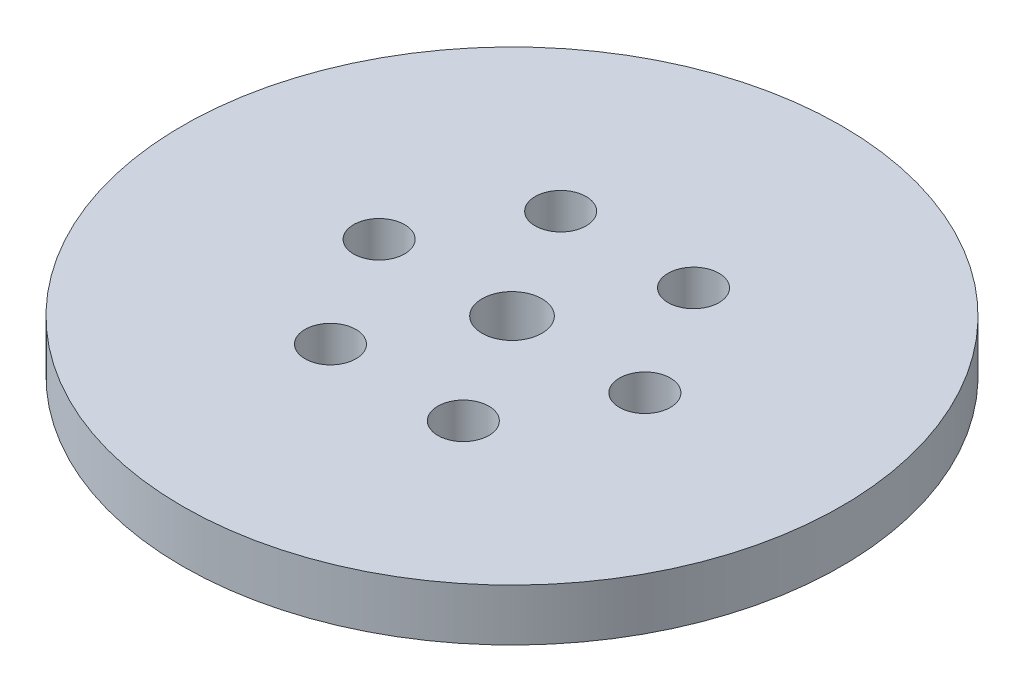
ISO-10303-21;
HEADER;
FILE_DESCRIPTION(('STEP AP214'),'2;1');
FILE_NAME('part.step','',(''),(''),'','','');
FILE_SCHEMA(('AUTOMOTIVE_DESIGN { 1 0 10303 214 1 1 1 1 }'));
ENDSEC;
DATA;
#1=APPLICATION_CONTEXT('core data for automotive mechanical design processes');
#2=APPLICATION_PROTOCOL_DEFINITION('international standard','automotive_design',2000,#1);
#3=PRODUCT_CONTEXT('',#1,'mechanical');
#4=PRODUCT('Part','Part','',(#3));
#5=PRODUCT_RELATED_PRODUCT_CATEGORY('part','',(#4));
#6=PRODUCT_DEFINITION_FORMATION('','',#4);
#7=PRODUCT_DEFINITION_CONTEXT('part definition',#1,'design');
#8=PRODUCT_DEFINITION('design','',#6,#7);
#9=PRODUCT_DEFINITION_SHAPE('','',#8);
#10=(LENGTH_UNIT() NAMED_UNIT(*) SI_UNIT(.MILLI.,.METRE.));
#11=(NAMED_UNIT(*) PLANE_ANGLE_UNIT() SI_UNIT($,.RADIAN.));
#12=(NAMED_UNIT(*) SI_UNIT($,.STERADIAN.) SOLID_ANGLE_UNIT());
#13=UNCERTAINTY_MEASURE_WITH_UNIT(LENGTH_MEASURE(1.E-05),#10,'distance_accuracy_value','');
#14=(GEOMETRIC_REPRESENTATION_CONTEXT(3) GLOBAL_UNCERTAINTY_ASSIGNED_CONTEXT((#13)) GLOBAL_UNIT_ASSIGNED_CONTEXT((#10,
#11,#12)) REPRESENTATION_CONTEXT('',''));
#15=CARTESIAN_POINT('',(0.,0.,0.));
#16=DIRECTION('',(0.,0.,1.));
#17=DIRECTION('',(1.,0.,0.));
#18=AXIS2_PLACEMENT_3D('',#15,#16,#17);
#19=CARTESIAN_POINT('',(0.,13.,0.));
#20=DIRECTION('',(0.,-1.,0.));
#21=DIRECTION('',(0.,0.,-1.));
#22=AXIS2_PLACEMENT_3D('',#19,#20,#21);
#23=CYLINDRICAL_SURFACE('',#22,82.5);
#24=CARTESIAN_POINT('',(0.,13.,0.));
#25=DIRECTION('',(0.,1.,0.));
#26=DIRECTION('',(0.,0.,1.));
#27=AXIS2_PLACEMENT_3D('',#24,#25,#26);
#28=CIRCLE('',#27,82.5);
#29=CARTESIAN_POINT('',(0.,13.,-82.5));
#30=VERTEX_POINT('',#29);
#31=EDGE_CURVE('E10',#30,#30,#28,.T.);
#32=CARTESIAN_POINT('',(0.,0.,0.));
#33=DIRECTION('',(0.,1.,0.));
#34=DIRECTION('',(0.,0.,1.));
#35=AXIS2_PLACEMENT_3D('',#32,#33,#34);
#36=CIRCLE('',#35,82.5);
#37=CARTESIAN_POINT('',(0.,0.,-82.5));
#38=VERTEX_POINT('',#37);
#39=EDGE_CURVE('E37',#38,#38,#36,.T.);
#40=CARTESIAN_POINT('',(0.,13.,-82.5));
#41=CARTESIAN_POINT('',(0.,12.8645833333333,-82.5));
#42=CARTESIAN_POINT('',(0.,12.7291666666667,-82.5));
#43=CARTESIAN_POINT('',(0.,12.4583333333333,-82.5));
#44=CARTESIAN_POINT('',(0.,12.3229166666667,-82.5));
#45=CARTESIAN_POINT('',(0.,12.0520833333333,-82.5));
#46=CARTESIAN_POINT('',(0.,11.9166666666667,-82.5));
#47=CARTESIAN_POINT('',(0.,11.6458333333333,-82.5));
#48=CARTESIAN_POINT('',(0.,11.5104166666667,-82.5));
#49=CARTESIAN_POINT('',(0.,11.2395833333333,-82.5));
#50=CARTESIAN_POINT('',(0.,11.1041666666667,-82.5));
#51=CARTESIAN_POINT('',(0.,10.8333333333333,-82.5));
#52=CARTESIAN_POINT('',(0.,10.6979166666667,-82.5));
#53=CARTESIAN_POINT('',(0.,10.4270833333333,-82.5));
#54=CARTESIAN_POINT('',(0.,10.2916666666667,-82.5));
#55=CARTESIAN_POINT('',(0.,10.0208333333333,-82.5));
#56=CARTESIAN_POINT('',(0.,9.88541666666667,-82.5));
#57=CARTESIAN_POINT('',(0.,9.61458333333333,-82.5));
#58=CARTESIAN_POINT('',(0.,9.47916666666667,-82.5));
#59=CARTESIAN_POINT('',(0.,9.20833333333333,-82.5));
#60=CARTESIAN_POINT('',(0.,9.07291666666667,-82.5));
#61=CARTESIAN_POINT('',(0.,8.80208333333333,-82.5));
#62=CARTESIAN_POINT('',(0.,8.66666666666667,-82.5));
#63=CARTESIAN_POINT('',(0.,8.39583333333333,-82.5));
#64=CARTESIAN_POINT('',(0.,8.26041666666667,-82.5));
#65=CARTESIAN_POINT('',(0.,7.98958333333333,-82.5));
#66=CARTESIAN_POINT('',(0.,7.85416666666667,-82.5));
#67=CARTESIAN_POINT('',(0.,7.58333333333333,-82.5));
#68=CARTESIAN_POINT('',(0.,7.44791666666667,-82.5));
#69=CARTESIAN_POINT('',(0.,7.17708333333333,-82.5));
#70=CARTESIAN_POINT('',(0.,7.04166666666667,-82.5));
#71=CARTESIAN_POINT('',(0.,6.77083333333333,-82.5));
#72=CARTESIAN_POINT('',(0.,6.63541666666667,-82.5));
#73=CARTESIAN_POINT('',(0.,6.36458333333333,-82.5));
#74=CARTESIAN_POINT('',(0.,6.22916666666667,-82.5));
#75=CARTESIAN_POINT('',(0.,5.95833333333333,-82.5));
#76=CARTESIAN_POINT('',(0.,5.82291666666667,-82.5));
#77=CARTESIAN_POINT('',(0.,5.55208333333333,-82.5));
#78=CARTESIAN_POINT('',(0.,5.41666666666667,-82.5));
#79=CARTESIAN_POINT('',(0.,5.14583333333333,-82.5));
#80=CARTESIAN_POINT('',(0.,5.01041666666667,-82.5));
#81=CARTESIAN_POINT('',(0.,4.73958333333333,-82.5));
#82=CARTESIAN_POINT('',(0.,4.60416666666667,-82.5));
#83=CARTESIAN_POINT('',(0.,4.33333333333333,-82.5));
#84=CARTESIAN_POINT('',(0.,4.19791666666667,-82.5));
#85=CARTESIAN_POINT('',(0.,3.92708333333333,-82.5));
#86=CARTESIAN_POINT('',(0.,3.79166666666667,-82.5));
#87=CARTESIAN_POINT('',(0.,3.52083333333333,-82.5));
#88=CARTESIAN_POINT('',(0.,3.38541666666667,-82.5));
#89=CARTESIAN_POINT('',(0.,3.11458333333333,-82.5));
#90=CARTESIAN_POINT('',(0.,2.97916666666667,-82.5));
#91=CARTESIAN_POINT('',(0.,2.70833333333333,-82.5));
#92=CARTESIAN_POINT('',(0.,2.57291666666667,-82.5));
#93=CARTESIAN_POINT('',(0.,2.30208333333333,-82.5));
#94=CARTESIAN_POINT('',(0.,2.16666666666667,-82.5));
#95=CARTESIAN_POINT('',(0.,1.89583333333333,-82.5));
#96=CARTESIAN_POINT('',(0.,1.76041666666667,-82.5));
#97=CARTESIAN_POINT('',(0.,1.48958333333333,-82.5));
#98=CARTESIAN_POINT('',(0.,1.35416666666667,-82.5));
#99=CARTESIAN_POINT('',(0.,1.08333333333333,-82.5));
#100=CARTESIAN_POINT('',(0.,0.947916666666667,-82.5));
#101=CARTESIAN_POINT('',(0.,0.677083333333334,-82.5));
#102=CARTESIAN_POINT('',(0.,0.541666666666667,-82.5));
#103=CARTESIAN_POINT('',(0.,0.270833333333334,-82.5));
#104=CARTESIAN_POINT('',(0.,0.135416666666667,-82.5));
#105=CARTESIAN_POINT('',(0.,0.,-82.5));
#106=B_SPLINE_CURVE_WITH_KNOTS('',3,(#40,#41,#42,#43,#44,#45,#46,#47,#48,#49,#50,#51,#52,#53,
#54,#55,#56,#57,#58,#59,#60,#61,#62,#63,#64,#65,#66,#67,#68,#69,#70,#71,#72,#73,#74,#75,#76,#77,
#78,#79,#80,#81,#82,#83,#84,#85,#86,#87,#88,#89,#90,#91,#92,#93,#94,#95,#96,#97,#98,#99,#100,
#101,#102,#103,#104,#105),.UNSPECIFIED.,.F.,.F.,(4,2,2,2,2,2,2,2,2,2,2,2,2,2,2,2,2,2,2,2,2,2,2,
2,2,2,2,2,2,2,2,2,4),(0.,0.406249999999999,0.812499999999999,1.21875,1.625,2.03125,2.4375,
2.84375,3.25,3.65625,4.0625,4.46875,4.875,5.28125,5.6875,6.09375,6.5,6.90625,7.3125,7.71875,
8.125,8.53125,8.9375,9.34375,9.75,10.15625,10.5625,10.96875,11.375,11.78125,12.1875,12.59375,
13.),.UNSPECIFIED.);
#107=EDGE_CURVE('BSEAM40',#30,#38,#106,.T.);
#108=ORIENTED_EDGE('',*,*,#31,.F.);
#109=ORIENTED_EDGE('',*,*,#39,.T.);
#110=ORIENTED_EDGE('',*,*,#107,.T.);
#111=ORIENTED_EDGE('',*,*,#107,.F.);
#112=EDGE_LOOP('',(#108,#110,#109,#111));
#113=FACE_BOUND('',#112,.T.);
#114=ADVANCED_FACE('F40',(#113),#23,.T.);
#115=CARTESIAN_POINT('',(0.,13.,0.));
#116=DIRECTION('',(0.,1.,0.));
#117=DIRECTION('',(0.,0.,1.));
#118=AXIS2_PLACEMENT_3D('',#115,#116,#117);
#119=PLANE('',#118);
#120=CARTESIAN_POINT('',(-16.6339672002721,13.,-28.8108763223047));
#121=DIRECTION('',(0.,1.,0.));
#122=DIRECTION('',(-0.866025403784433,0.,0.50000000000001));
#123=AXIS2_PLACEMENT_3D('',#120,#121,#122);
#124=CIRCLE('',#123,6.37895081051174);
#125=CARTESIAN_POINT('',(-22.1583006516666,13.,-25.6214009170488));
#126=VERTEX_POINT('',#125);
#127=EDGE_CURVE('E70',#126,#126,#124,.T.);
#128=ORIENTED_EDGE('',*,*,#127,.F.);
#129=EDGE_LOOP('',(#128));
#130=FACE_BOUND('',#129,.T.);
#131=CARTESIAN_POINT('',(16.6339672002715,13.,-28.8108763223051));
#132=DIRECTION('',(0.,1.,0.));
#133=DIRECTION('',(-0.866025403784443,0.,-0.499999999999992));
#134=AXIS2_PLACEMENT_3D('',#131,#132,#133);
#135=CIRCLE('',#134,6.37895081051174);
#136=CARTESIAN_POINT('',(11.109633748877,13.,-32.0003517275609));
#137=VERTEX_POINT('',#136);
#138=EDGE_CURVE('E71',#137,#137,#135,.T.);
#139=ORIENTED_EDGE('',*,*,#138,.F.);
#140=EDGE_LOOP('',(#139));
#141=FACE_BOUND('',#140,.T.);
#142=CARTESIAN_POINT('',(33.2679344005435,13.,0.));
#143=DIRECTION('',(0.,1.,0.));
#144=DIRECTION('',(0.,0.,-1.));
#145=AXIS2_PLACEMENT_3D('',#142,#143,#144);
#146=CIRCLE('',#145,6.37895081051174);
#147=CARTESIAN_POINT('',(33.2679344005435,13.,-6.37895081051174));
#148=VERTEX_POINT('',#147);
#149=EDGE_CURVE('E78',#148,#148,#146,.T.);
#150=ORIENTED_EDGE('',*,*,#149,.F.);
#151=EDGE_LOOP('',(#150));
#152=FACE_BOUND('',#151,.T.);
#153=CARTESIAN_POINT('',(16.6339672002719,13.,28.8108763223048));
#154=DIRECTION('',(0.,1.,0.));
#155=DIRECTION('',(0.866025403784436,0.,-0.500000000000004));
#156=AXIS2_PLACEMENT_3D('',#153,#154,#155);
#157=CIRCLE('',#156,6.37895081051174);
#158=CARTESIAN_POINT('',(22.1583006516664,13.,25.621400917049));
#159=VERTEX_POINT('',#158);
#160=EDGE_CURVE('E84',#159,#159,#157,.T.);
#161=ORIENTED_EDGE('',*,*,#160,.F.);
#162=EDGE_LOOP('',(#161));
#163=FACE_BOUND('',#162,.T.);
#164=CARTESIAN_POINT('',(-16.6339672002717,13.,28.810876322305));
#165=DIRECTION('',(0.,1.,0.));
#166=DIRECTION('',(0.86602540378444,0.,0.499999999999998));
#167=AXIS2_PLACEMENT_3D('',#164,#165,#166);
#168=CIRCLE('',#167,6.37895081051174);
#169=CARTESIAN_POINT('',(-11.1096337488772,13.,32.0003517275608));
#170=VERTEX_POINT('',#169);
#171=EDGE_CURVE('E61',#170,#170,#168,.T.);
#172=ORIENTED_EDGE('',*,*,#171,.F.);
#173=EDGE_LOOP('',(#172));
#174=FACE_BOUND('',#173,.T.);
#175=CARTESIAN_POINT('',(-33.2679344005435,13.,0.));
#176=DIRECTION('',(0.,1.,0.));
#177=DIRECTION('',(0.,0.,1.));
#178=AXIS2_PLACEMENT_3D('',#175,#176,#177);
#179=CIRCLE('',#178,6.37895081051174);
#180=CARTESIAN_POINT('',(-33.2679344005435,13.,6.37895081051174));
#181=VERTEX_POINT('',#180);
#182=EDGE_CURVE('E54',#181,#181,#179,.T.);
#183=ORIENTED_EDGE('',*,*,#182,.F.);
#184=EDGE_LOOP('',(#183));
#185=FACE_BOUND('',#184,.T.);
#186=CARTESIAN_POINT('',(0.,13.,0.));
#187=DIRECTION('',(0.,1.,0.));
#188=DIRECTION('',(0.,0.,1.));
#189=AXIS2_PLACEMENT_3D('',#186,#187,#188);
#190=CIRCLE('',#189,7.5);
#191=CARTESIAN_POINT('',(0.,13.,-7.5));
#192=VERTEX_POINT('',#191);
#193=EDGE_CURVE('E50',#192,#192,#190,.T.);
#194=ORIENTED_EDGE('',*,*,#193,.F.);
#195=EDGE_LOOP('',(#194));
#196=FACE_BOUND('',#195,.T.);
#197=ORIENTED_EDGE('',*,*,#31,.T.);
#198=EDGE_LOOP('',(#197));
#199=FACE_BOUND('',#198,.T.);
#200=ADVANCED_FACE('F99',(#130,#141,#152,#163,#174,#185,#196,#199),#119,.T.);
#201=CARTESIAN_POINT('',(0.,0.,0.));
#202=DIRECTION('',(0.,1.,0.));
#203=DIRECTION('',(0.,0.,1.));
#204=AXIS2_PLACEMENT_3D('',#201,#202,#203);
#205=PLANE('',#204);
#206=CARTESIAN_POINT('',(0.,0.,0.));
#207=DIRECTION('',(0.,1.,0.));
#208=DIRECTION('',(0.,0.,1.));
#209=AXIS2_PLACEMENT_3D('',#206,#207,#208);
#210=CIRCLE('',#209,7.5);
#211=CARTESIAN_POINT('',(0.,0.,-7.5));
#212=VERTEX_POINT('',#211);
#213=EDGE_CURVE('E47',#212,#212,#210,.T.);
#214=ORIENTED_EDGE('',*,*,#213,.T.);
#215=EDGE_LOOP('',(#214));
#216=FACE_BOUND('',#215,.T.);
#217=ORIENTED_EDGE('',*,*,#39,.F.);
#218=EDGE_LOOP('',(#217));
#219=FACE_BOUND('',#218,.T.);
#220=ADVANCED_FACE('F103',(#216,#219),#205,.F.);
#221=CARTESIAN_POINT('',(0.,13.,0.));
#222=DIRECTION('',(0.,-1.,0.));
#223=DIRECTION('',(0.,0.,-1.));
#224=AXIS2_PLACEMENT_3D('',#221,#222,#223);
#225=CYLINDRICAL_SURFACE('',#224,7.5);
#226=CARTESIAN_POINT('',(0.,13.,-7.5));
#227=CARTESIAN_POINT('',(0.,12.8645833333333,-7.5));
#228=CARTESIAN_POINT('',(0.,12.7291666666667,-7.5));
#229=CARTESIAN_POINT('',(0.,12.4583333333333,-7.5));
#230=CARTESIAN_POINT('',(0.,12.3229166666667,-7.5));
#231=CARTESIAN_POINT('',(0.,12.0520833333333,-7.5));
#232=CARTESIAN_POINT('',(0.,11.9166666666667,-7.5));
#233=CARTESIAN_POINT('',(0.,11.6458333333333,-7.5));
#234=CARTESIAN_POINT('',(0.,11.5104166666667,-7.5));
#235=CARTESIAN_POINT('',(0.,11.2395833333333,-7.5));
#236=CARTESIAN_POINT('',(0.,11.1041666666667,-7.5));
#237=CARTESIAN_POINT('',(0.,10.8333333333333,-7.5));
#238=CARTESIAN_POINT('',(0.,10.6979166666667,-7.5));
#239=CARTESIAN_POINT('',(0.,10.4270833333333,-7.5));
#240=CARTESIAN_POINT('',(0.,10.2916666666667,-7.5));
#241=CARTESIAN_POINT('',(0.,10.0208333333333,-7.5));
#242=CARTESIAN_POINT('',(0.,9.88541666666667,-7.5));
#243=CARTESIAN_POINT('',(0.,9.61458333333333,-7.5));
#244=CARTESIAN_POINT('',(0.,9.47916666666667,-7.5));
#245=CARTESIAN_POINT('',(0.,9.20833333333333,-7.5));
#246=CARTESIAN_POINT('',(0.,9.07291666666666,-7.5));
#247=CARTESIAN_POINT('',(0.,8.80208333333333,-7.5));
#248=CARTESIAN_POINT('',(0.,8.66666666666667,-7.5));
#249=CARTESIAN_POINT('',(0.,8.39583333333333,-7.5));
#250=CARTESIAN_POINT('',(0.,8.26041666666667,-7.5));
#251=CARTESIAN_POINT('',(0.,7.98958333333333,-7.5));
#252=CARTESIAN_POINT('',(0.,7.85416666666667,-7.5));
#253=CARTESIAN_POINT('',(0.,7.58333333333333,-7.5));
#254=CARTESIAN_POINT('',(0.,7.44791666666667,-7.5));
#255=CARTESIAN_POINT('',(0.,7.17708333333333,-7.5));
#256=CARTESIAN_POINT('',(0.,7.04166666666667,-7.5));
#257=CARTESIAN_POINT('',(0.,6.77083333333333,-7.5));
#258=CARTESIAN_POINT('',(0.,6.63541666666667,-7.5));
#259=CARTESIAN_POINT('',(0.,6.36458333333333,-7.5));
#260=CARTESIAN_POINT('',(0.,6.22916666666667,-7.5));
#261=CARTESIAN_POINT('',(0.,5.95833333333333,-7.5));
#262=CARTESIAN_POINT('',(0.,5.82291666666667,-7.5));
#263=CARTESIAN_POINT('',(0.,5.55208333333333,-7.5));
#264=CARTESIAN_POINT('',(0.,5.41666666666667,-7.5));
#265=CARTESIAN_POINT('',(0.,5.14583333333333,-7.5));
#266=CARTESIAN_POINT('',(0.,5.01041666666667,-7.5));
#267=CARTESIAN_POINT('',(0.,4.73958333333333,-7.5));
#268=CARTESIAN_POINT('',(0.,4.60416666666667,-7.5));
#269=CARTESIAN_POINT('',(0.,4.33333333333333,-7.5));
#270=CARTESIAN_POINT('',(0.,4.19791666666667,-7.5));
#271=CARTESIAN_POINT('',(0.,3.92708333333333,-7.5));
#272=CARTESIAN_POINT('',(0.,3.79166666666667,-7.5));
#273=CARTESIAN_POINT('',(0.,3.52083333333333,-7.5));
#274=CARTESIAN_POINT('',(0.,3.38541666666667,-7.5));
#275=CARTESIAN_POINT('',(0.,3.11458333333333,-7.5));
#276=CARTESIAN_POINT('',(0.,2.97916666666667,-7.5));
#277=CARTESIAN_POINT('',(0.,2.70833333333333,-7.5));
#278=CARTESIAN_POINT('',(0.,2.57291666666667,-7.5));
#279=CARTESIAN_POINT('',(0.,2.30208333333333,-7.5));
#280=CARTESIAN_POINT('',(0.,2.16666666666667,-7.5));
#281=CARTESIAN_POINT('',(0.,1.89583333333333,-7.5));
#282=CARTESIAN_POINT('',(0.,1.76041666666667,-7.5));
#283=CARTESIAN_POINT('',(0.,1.48958333333333,-7.5));
#284=CARTESIAN_POINT('',(0.,1.35416666666667,-7.5));
#285=CARTESIAN_POINT('',(0.,1.08333333333333,-7.5));
#286=CARTESIAN_POINT('',(0.,0.947916666666667,-7.5));
#287=CARTESIAN_POINT('',(0.,0.677083333333334,-7.5));
#288=CARTESIAN_POINT('',(0.,0.541666666666667,-7.5));
#289=CARTESIAN_POINT('',(0.,0.270833333333334,-7.5));
#290=CARTESIAN_POINT('',(0.,0.135416666666667,-7.5));
#291=CARTESIAN_POINT('',(0.,0.,-7.5));
#292=B_SPLINE_CURVE_WITH_KNOTS('',3,(#226,#227,#228,#229,#230,#231,#232,#233,#234,#235,#236,
#237,#238,#239,#240,#241,#242,#243,#244,#245,#246,#247,#248,#249,#250,#251,#252,#253,#254,#255,
#256,#257,#258,#259,#260,#261,#262,#263,#264,#265,#266,#267,#268,#269,#270,#271,#272,#273,#274,
#275,#276,#277,#278,#279,#280,#281,#282,#283,#284,#285,#286,#287,#288,#289,#290,#291),
.UNSPECIFIED.,.F.,.F.,(4,2,2,2,2,2,2,2,2,2,2,2,2,2,2,2,2,2,2,2,2,2,2,2,2,2,2,2,2,2,2,2,4),(0.,
0.40625,0.812500000000001,1.21875,1.625,2.03125,2.4375,2.84375,3.25,3.65625,4.0625,4.46875,
4.875,5.28125,5.6875,6.09375,6.5,6.90625,7.3125,7.71875,8.125,8.53125,8.9375,9.34375,9.75,
10.15625,10.5625,10.96875,11.375,11.78125,12.1875,12.59375,13.),.UNSPECIFIED.);
#293=EDGE_CURVE('BSEAM115',#192,#212,#292,.T.);
#294=ORIENTED_EDGE('',*,*,#193,.T.);
#295=ORIENTED_EDGE('',*,*,#213,.F.);
#296=ORIENTED_EDGE('',*,*,#293,.T.);
#297=ORIENTED_EDGE('',*,*,#293,.F.);
#298=EDGE_LOOP('',(#294,#296,#295,#297));
#299=FACE_BOUND('',#298,.T.);
#300=ADVANCED_FACE('F115',(#299),#225,.F.);
#301=CARTESIAN_POINT('',(-33.2679344005435,1.84640971704443,0.));
#302=DIRECTION('',(0.,1.,0.));
#303=DIRECTION('',(0.,0.,1.));
#304=AXIS2_PLACEMENT_3D('',#301,#302,#303);
#305=CYLINDRICAL_SURFACE('',#304,6.37895081051174);
#306=CARTESIAN_POINT('',(-33.2679344005435,1.84640971704443,0.));
#307=DIRECTION('',(0.,1.,0.));
#308=DIRECTION('',(0.,0.,1.));
#309=AXIS2_PLACEMENT_3D('',#306,#307,#308);
#310=CIRCLE('',#309,6.37895081051174);
#311=CARTESIAN_POINT('',(-33.2679344005435,1.84640971704443,6.37895081051174));
#312=VERTEX_POINT('',#311);
#313=EDGE_CURVE('E55',#312,#312,#310,.T.);
#314=ORIENTED_EDGE('',*,*,#313,.F.);
#315=EDGE_LOOP('',(#314));
#316=FACE_BOUND('',#315,.T.);
#317=ORIENTED_EDGE('',*,*,#182,.T.);
#318=EDGE_LOOP('',(#317));
#319=FACE_BOUND('',#318,.T.);
#320=ADVANCED_FACE('F113',(#316,#319),#305,.F.);
#321=CARTESIAN_POINT('',(-33.2679344005435,1.84640971704443,0.));
#322=DIRECTION('',(0.,1.,0.));
#323=DIRECTION('',(0.,0.,1.));
#324=AXIS2_PLACEMENT_3D('',#321,#322,#323);
#325=PLANE('',#324);
#326=ORIENTED_EDGE('',*,*,#313,.T.);
#327=EDGE_LOOP('',(#326));
#328=FACE_BOUND('',#327,.T.);
#329=ADVANCED_FACE('F144',(#328),#325,.T.);
#330=CARTESIAN_POINT('',(-16.6339672002717,1.84640971704443,28.810876322305));
#331=DIRECTION('',(0.,1.,0.));
#332=DIRECTION('',(0.,0.,1.));
#333=AXIS2_PLACEMENT_3D('',#330,#331,#332);
#334=CYLINDRICAL_SURFACE('',#333,6.37895081051174);
#335=CARTESIAN_POINT('',(-16.6339672002717,1.84640971704443,28.810876322305));
#336=DIRECTION('',(0.,1.,0.));
#337=DIRECTION('',(0.86602540378444,0.,0.499999999999998));
#338=AXIS2_PLACEMENT_3D('',#335,#336,#337);
#339=CIRCLE('',#338,6.37895081051174);
#340=CARTESIAN_POINT('',(-11.1096337488772,1.84640971704443,32.0003517275608));
#341=VERTEX_POINT('',#340);
#342=EDGE_CURVE('E59',#341,#341,#339,.T.);
#343=ORIENTED_EDGE('',*,*,#342,.F.);
#344=EDGE_LOOP('',(#343));
#345=FACE_BOUND('',#344,.T.);
#346=ORIENTED_EDGE('',*,*,#171,.T.);
#347=EDGE_LOOP('',(#346));
#348=FACE_BOUND('',#347,.T.);
#349=ADVANCED_FACE('F153',(#345,#348),#334,.F.);
#350=CARTESIAN_POINT('',(-16.6339672002717,1.84640971704443,28.810876322305));
#351=DIRECTION('',(0.,1.,0.));
#352=DIRECTION('',(0.86602540378444,0.,0.499999999999998));
#353=AXIS2_PLACEMENT_3D('',#350,#351,#352);
#354=PLANE('',#353);
#355=ORIENTED_EDGE('',*,*,#342,.T.);
#356=EDGE_LOOP('',(#355));
#357=FACE_BOUND('',#356,.T.);
#358=ADVANCED_FACE('F96',(#357),#354,.T.);
#359=CARTESIAN_POINT('',(16.6339672002719,1.84640971704443,28.8108763223048));
#360=DIRECTION('',(0.,1.,0.));
#361=DIRECTION('',(0.,0.,1.));
#362=AXIS2_PLACEMENT_3D('',#359,#360,#361);
#363=CYLINDRICAL_SURFACE('',#362,6.37895081051174);
#364=CARTESIAN_POINT('',(16.6339672002719,1.84640971704443,28.8108763223048));
#365=DIRECTION('',(0.,1.,0.));
#366=DIRECTION('',(0.866025403784436,0.,-0.500000000000004));
#367=AXIS2_PLACEMENT_3D('',#364,#365,#366);
#368=CIRCLE('',#367,6.37895081051174);
#369=CARTESIAN_POINT('',(22.1583006516664,1.84640971704443,25.621400917049));
#370=VERTEX_POINT('',#369);
#371=EDGE_CURVE('E63',#370,#370,#368,.T.);
#372=ORIENTED_EDGE('',*,*,#371,.F.);
#373=EDGE_LOOP('',(#372));
#374=FACE_BOUND('',#373,.T.);
#375=ORIENTED_EDGE('',*,*,#160,.T.);
#376=EDGE_LOOP('',(#375));
#377=FACE_BOUND('',#376,.T.);
#378=ADVANCED_FACE('F91',(#374,#377),#363,.F.);
#379=CARTESIAN_POINT('',(16.6339672002719,1.84640971704443,28.8108763223048));
#380=DIRECTION('',(0.,1.,0.));
#381=DIRECTION('',(0.866025403784436,0.,-0.500000000000004));
#382=AXIS2_PLACEMENT_3D('',#379,#380,#381);
#383=PLANE('',#382);
#384=ORIENTED_EDGE('',*,*,#371,.T.);
#385=EDGE_LOOP('',(#384));
#386=FACE_BOUND('',#385,.T.);
#387=ADVANCED_FACE('F93',(#386),#383,.T.);
#388=CARTESIAN_POINT('',(33.2679344005435,1.84640971704443,0.));
#389=DIRECTION('',(0.,1.,0.));
#390=DIRECTION('',(0.,0.,1.));
#391=AXIS2_PLACEMENT_3D('',#388,#389,#390);
#392=CYLINDRICAL_SURFACE('',#391,6.37895081051174);
#393=CARTESIAN_POINT('',(33.2679344005435,1.84640971704443,0.));
#394=DIRECTION('',(0.,1.,0.));
#395=DIRECTION('',(0.,0.,-1.));
#396=AXIS2_PLACEMENT_3D('',#393,#394,#395);
#397=CIRCLE('',#396,6.37895081051174);
#398=CARTESIAN_POINT('',(33.2679344005435,1.84640971704443,-6.37895081051174));
#399=VERTEX_POINT('',#398);
#400=EDGE_CURVE('E85',#399,#399,#397,.T.);
#401=ORIENTED_EDGE('',*,*,#400,.F.);
#402=EDGE_LOOP('',(#401));
#403=FACE_BOUND('',#402,.T.);
#404=ORIENTED_EDGE('',*,*,#149,.T.);
#405=EDGE_LOOP('',(#404));
#406=FACE_BOUND('',#405,.T.);
#407=ADVANCED_FACE('F187',(#403,#406),#392,.F.);
#408=CARTESIAN_POINT('',(33.2679344005435,1.84640971704443,0.));
#409=DIRECTION('',(0.,1.,0.));
#410=DIRECTION('',(0.,0.,-1.));
#411=AXIS2_PLACEMENT_3D('',#408,#409,#410);
#412=PLANE('',#411);
#413=ORIENTED_EDGE('',*,*,#400,.T.);
#414=EDGE_LOOP('',(#413));
#415=FACE_BOUND('',#414,.T.);
#416=ADVANCED_FACE('F198',(#415),#412,.T.);
#417=CARTESIAN_POINT('',(16.6339672002715,1.84640971704443,-28.8108763223051));
#418=DIRECTION('',(0.,1.,0.));
#419=DIRECTION('',(0.,0.,1.));
#420=AXIS2_PLACEMENT_3D('',#417,#418,#419);
#421=CYLINDRICAL_SURFACE('',#420,6.37895081051174);
#422=CARTESIAN_POINT('',(16.6339672002715,1.84640971704443,-28.8108763223051));
#423=DIRECTION('',(0.,1.,0.));
#424=DIRECTION('',(-0.866025403784443,0.,-0.499999999999992));
#425=AXIS2_PLACEMENT_3D('',#422,#423,#424);
#426=CIRCLE('',#425,6.37895081051174);
#427=CARTESIAN_POINT('',(11.109633748877,1.84640971704443,-32.0003517275609));
#428=VERTEX_POINT('',#427);
#429=EDGE_CURVE('E76',#428,#428,#426,.T.);
#430=ORIENTED_EDGE('',*,*,#429,.F.);
#431=EDGE_LOOP('',(#430));
#432=FACE_BOUND('',#431,.T.);
#433=ORIENTED_EDGE('',*,*,#138,.T.);
#434=EDGE_LOOP('',(#433));
#435=FACE_BOUND('',#434,.T.);
#436=ADVANCED_FACE('F202',(#432,#435),#421,.F.);
#437=CARTESIAN_POINT('',(16.6339672002715,1.84640971704443,-28.8108763223051));
#438=DIRECTION('',(0.,1.,0.));
#439=DIRECTION('',(-0.866025403784443,0.,-0.499999999999992));
#440=AXIS2_PLACEMENT_3D('',#437,#438,#439);
#441=PLANE('',#440);
#442=ORIENTED_EDGE('',*,*,#429,.T.);
#443=EDGE_LOOP('',(#442));
#444=FACE_BOUND('',#443,.T.);
#445=ADVANCED_FACE('F212',(#444),#441,.T.);
#446=CARTESIAN_POINT('',(-16.6339672002721,1.84640971704443,-28.8108763223047));
#447=DIRECTION('',(0.,1.,0.));
#448=DIRECTION('',(0.,0.,1.));
#449=AXIS2_PLACEMENT_3D('',#446,#447,#448);
#450=CYLINDRICAL_SURFACE('',#449,6.37895081051174);
#451=CARTESIAN_POINT('',(-16.6339672002721,1.84640971704443,-28.8108763223047));
#452=DIRECTION('',(0.,1.,0.));
#453=DIRECTION('',(-0.866025403784433,0.,0.50000000000001));
#454=AXIS2_PLACEMENT_3D('',#451,#452,#453);
#455=CIRCLE('',#454,6.37895081051174);
#456=CARTESIAN_POINT('',(-22.1583006516666,1.84640971704443,-25.6214009170488));
#457=VERTEX_POINT('',#456);
#458=EDGE_CURVE('E69',#457,#457,#455,.T.);
#459=ORIENTED_EDGE('',*,*,#458,.F.);
#460=EDGE_LOOP('',(#459));
#461=FACE_BOUND('',#460,.T.);
#462=ORIENTED_EDGE('',*,*,#127,.T.);
#463=EDGE_LOOP('',(#462));
#464=FACE_BOUND('',#463,.T.);
#465=ADVANCED_FACE('F224',(#461,#464),#450,.F.);
#466=CARTESIAN_POINT('',(-16.6339672002721,1.84640971704443,-28.8108763223047));
#467=DIRECTION('',(0.,1.,0.));
#468=DIRECTION('',(-0.866025403784433,0.,0.50000000000001));
#469=AXIS2_PLACEMENT_3D('',#466,#467,#468);
#470=PLANE('',#469);
#471=ORIENTED_EDGE('',*,*,#458,.T.);
#472=EDGE_LOOP('',(#471));
#473=FACE_BOUND('',#472,.T.);
#474=ADVANCED_FACE('F235',(#473),#470,.T.);
#475=CLOSED_SHELL('',(#114,#200,#220,#300,#320,#329,#349,#358,#378,#387,#407,#416,#436,#445,
#465,#474));
#476=MANIFOLD_SOLID_BREP('B2',#475);
#477=ADVANCED_BREP_SHAPE_REPRESENTATION('',(#18,#476),#14);
#478=SHAPE_DEFINITION_REPRESENTATION(#9,#477);
ENDSEC;
END-ISO-10303-21;
